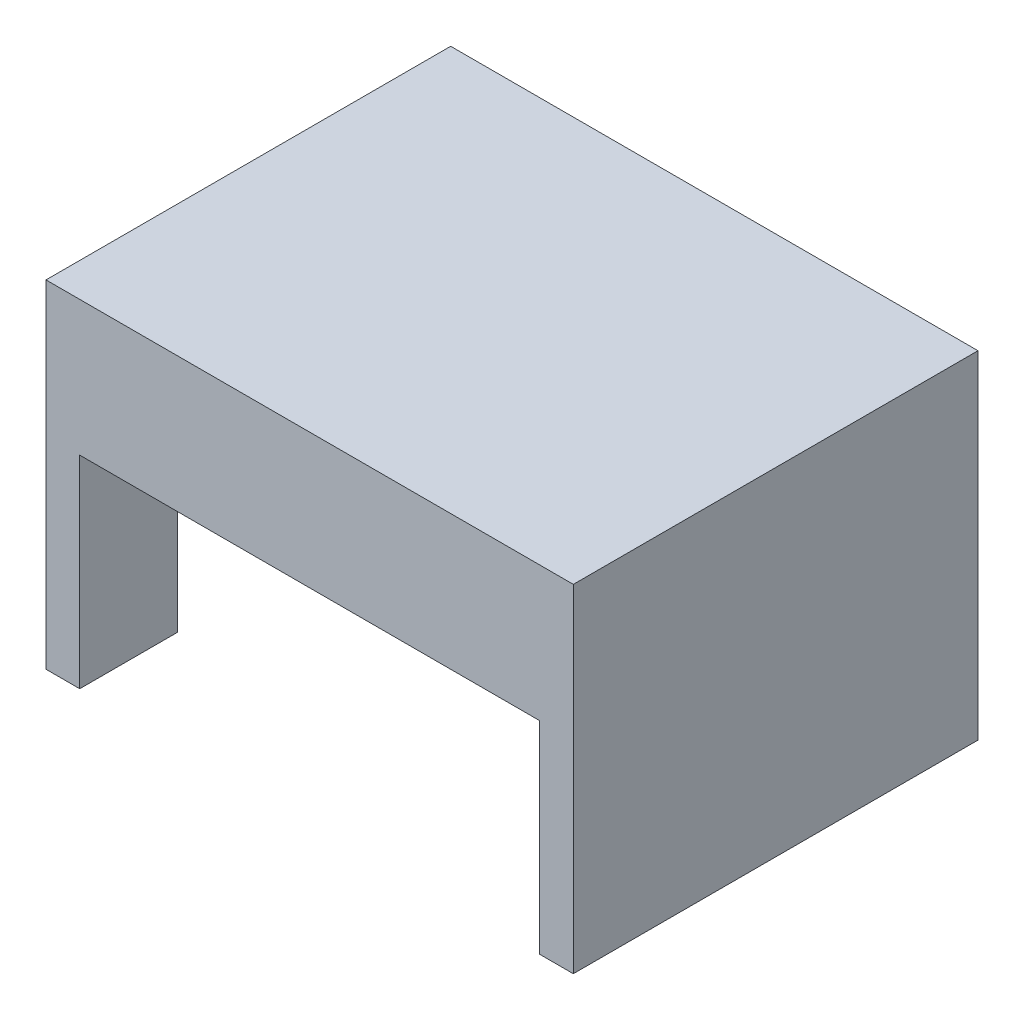
ISO-10303-21;
HEADER;
FILE_DESCRIPTION(('STEP AP214'),'2;1');
FILE_NAME('part.step','',(''),(''),'','','');
FILE_SCHEMA(('AUTOMOTIVE_DESIGN { 1 0 10303 214 1 1 1 1 }'));
ENDSEC;
DATA;
#1=APPLICATION_CONTEXT('core data for automotive mechanical design processes');
#2=APPLICATION_PROTOCOL_DEFINITION('international standard','automotive_design',2000,#1);
#3=PRODUCT_CONTEXT('',#1,'mechanical');
#4=PRODUCT('Part','Part','',(#3));
#5=PRODUCT_RELATED_PRODUCT_CATEGORY('part','',(#4));
#6=PRODUCT_DEFINITION_FORMATION('','',#4);
#7=PRODUCT_DEFINITION_CONTEXT('part definition',#1,'design');
#8=PRODUCT_DEFINITION('design','',#6,#7);
#9=PRODUCT_DEFINITION_SHAPE('','',#8);
#10=(LENGTH_UNIT() NAMED_UNIT(*) SI_UNIT(.MILLI.,.METRE.));
#11=(NAMED_UNIT(*) PLANE_ANGLE_UNIT() SI_UNIT($,.RADIAN.));
#12=(NAMED_UNIT(*) SI_UNIT($,.STERADIAN.) SOLID_ANGLE_UNIT());
#13=UNCERTAINTY_MEASURE_WITH_UNIT(LENGTH_MEASURE(1.E-05),#10,'distance_accuracy_value','');
#14=(GEOMETRIC_REPRESENTATION_CONTEXT(3) GLOBAL_UNCERTAINTY_ASSIGNED_CONTEXT((#13)) GLOBAL_UNIT_ASSIGNED_CONTEXT((#10,
#11,#12)) REPRESENTATION_CONTEXT('',''));
#15=CARTESIAN_POINT('',(0.,0.,0.));
#16=DIRECTION('',(0.,0.,1.));
#17=DIRECTION('',(1.,0.,0.));
#18=AXIS2_PLACEMENT_3D('',#15,#16,#17);
#19=CARTESIAN_POINT('',(-56.4103801603801,-36.4285714285714,60.));
#20=DIRECTION('',(0.,1.,0.));
#21=DIRECTION('',(0.,0.,1.));
#22=AXIS2_PLACEMENT_3D('',#19,#20,#21);
#23=PLANE('',#22);
#24=DIRECTION('',(0.,0.,-1.));
#25=VECTOR('',#24,1.);
#26=CARTESIAN_POINT('',(-51.4103801603801,-36.4285714285714,60.));
#27=LINE('',#26,#25);
#28=CARTESIAN_POINT('',(-51.4103801603801,-36.4285714285714,14.5));
#29=VERTEX_POINT('',#28);
#30=CARTESIAN_POINT('',(-51.4103801603801,-36.4285714285714,0.));
#31=VERTEX_POINT('',#30);
#32=EDGE_CURVE('E109',#29,#31,#27,.T.);
#33=ORIENTED_EDGE('',*,*,#32,.F.);
#34=DIRECTION('',(1.,0.,0.));
#35=VECTOR('',#34,1.);
#36=CARTESIAN_POINT('',(-51.4103801603801,-36.4285714285714,14.5));
#37=LINE('',#36,#35);
#38=CARTESIAN_POINT('',(-56.4103801603801,-36.4285714285714,14.5));
#39=VERTEX_POINT('',#38);
#40=EDGE_CURVE('E284',#39,#29,#37,.T.);
#41=ORIENTED_EDGE('',*,*,#40,.F.);
#42=DIRECTION('',(0.,0.,-1.));
#43=VECTOR('',#42,1.);
#44=CARTESIAN_POINT('',(-56.4103801603801,-36.4285714285714,60.));
#45=LINE('',#44,#43);
#46=CARTESIAN_POINT('',(-56.4103801603801,-36.4285714285714,0.));
#47=VERTEX_POINT('',#46);
#48=EDGE_CURVE('E224',#39,#47,#45,.T.);
#49=ORIENTED_EDGE('',*,*,#48,.T.);
#50=DIRECTION('',(1.,0.,0.));
#51=VECTOR('',#50,1.);
#52=CARTESIAN_POINT('',(-56.4103801603801,-36.4285714285714,0.));
#53=LINE('',#52,#51);
#54=EDGE_CURVE('E189',#47,#31,#53,.T.);
#55=ORIENTED_EDGE('',*,*,#54,.T.);
#56=EDGE_LOOP('',(#33,#41,#49,#55));
#57=FACE_BOUND('',#56,.T.);
#58=ADVANCED_FACE('F71',(#57),#23,.F.);
#59=CARTESIAN_POINT('',(-51.4103801603801,-6.42857142857144,60.));
#60=DIRECTION('',(1.,0.,0.));
#61=DIRECTION('',(0.,1.,0.));
#62=AXIS2_PLACEMENT_3D('',#59,#60,#61);
#63=PLANE('',#62);
#64=DIRECTION('',(0.,-1.,0.));
#65=VECTOR('',#64,1.);
#66=CARTESIAN_POINT('',(-51.4103801603801,3.57142857142857,14.5));
#67=LINE('',#66,#65);
#68=CARTESIAN_POINT('',(-51.4103801603801,-6.42857142857144,14.5));
#69=VERTEX_POINT('',#68);
#70=EDGE_CURVE('E265',#69,#29,#67,.T.);
#71=ORIENTED_EDGE('',*,*,#70,.T.);
#72=ORIENTED_EDGE('',*,*,#32,.T.);
#73=DIRECTION('',(0.,-1.,0.));
#74=VECTOR('',#73,1.);
#75=CARTESIAN_POINT('',(-51.4103801603801,-6.42857142857144,0.));
#76=LINE('',#75,#74);
#77=CARTESIAN_POINT('',(-51.4103801603801,-6.42857142857144,0.));
#78=VERTEX_POINT('',#77);
#79=EDGE_CURVE('E216',#78,#31,#76,.T.);
#80=ORIENTED_EDGE('',*,*,#79,.F.);
#81=DIRECTION('',(0.,0.,-1.));
#82=VECTOR('',#81,1.);
#83=CARTESIAN_POINT('',(-51.4103801603801,-6.42857142857144,60.));
#84=LINE('',#83,#82);
#85=EDGE_CURVE('E82',#69,#78,#84,.T.);
#86=ORIENTED_EDGE('',*,*,#85,.F.);
#87=EDGE_LOOP('',(#71,#72,#80,#86));
#88=FACE_BOUND('',#87,.T.);
#89=ADVANCED_FACE('F334',(#88),#63,.T.);
#90=CARTESIAN_POINT('',(0.,-6.42857142857144,60.));
#91=DIRECTION('',(0.,1.,0.));
#92=DIRECTION('',(-1.,0.,0.));
#93=AXIS2_PLACEMENT_3D('',#90,#91,#92);
#94=PLANE('',#93);
#95=CARTESIAN_POINT('',(-51.4103801603801,-6.42857142857144,60.));
#96=VERTEX_POINT('',#95);
#97=CARTESIAN_POINT('',(-51.4103801603801,-6.42857142857144,45.5));
#98=VERTEX_POINT('',#97);
#99=EDGE_CURVE('E12',#96,#98,#84,.T.);
#100=ORIENTED_EDGE('',*,*,#99,.T.);
#101=DIRECTION('',(-1.,0.,0.));
#102=VECTOR('',#101,1.);
#103=CARTESIAN_POINT('',(-51.4103801603801,-6.42857142857144,45.5));
#104=LINE('',#103,#102);
#105=CARTESIAN_POINT('',(16.7764330264331,-6.42857142857144,45.5));
#106=VERTEX_POINT('',#105);
#107=EDGE_CURVE('E257',#106,#98,#104,.T.);
#108=ORIENTED_EDGE('',*,*,#107,.F.);
#109=DIRECTION('',(0.,0.,-1.));
#110=VECTOR('',#109,1.);
#111=CARTESIAN_POINT('',(16.7764330264331,-6.42857142857144,60.));
#112=LINE('',#111,#110);
#113=CARTESIAN_POINT('',(16.7764330264331,-6.42857142857144,60.));
#114=VERTEX_POINT('',#113);
#115=EDGE_CURVE('E207',#114,#106,#112,.T.);
#116=ORIENTED_EDGE('',*,*,#115,.F.);
#117=DIRECTION('',(1.,0.,0.));
#118=VECTOR('',#117,1.);
#119=CARTESIAN_POINT('',(0.,-6.42857142857144,60.));
#120=LINE('',#119,#118);
#121=EDGE_CURVE('E191',#96,#114,#120,.T.);
#122=ORIENTED_EDGE('',*,*,#121,.F.);
#123=EDGE_LOOP('',(#100,#108,#116,#122));
#124=FACE_BOUND('',#123,.T.);
#125=ADVANCED_FACE('F338',(#124),#94,.F.);
#126=CARTESIAN_POINT('',(16.7764330264331,-6.42857142857144,14.5));
#127=VERTEX_POINT('',#126);
#128=CARTESIAN_POINT('',(16.7764330264331,-6.42857142857144,0.));
#129=VERTEX_POINT('',#128);
#130=EDGE_CURVE('E206',#127,#129,#112,.T.);
#131=ORIENTED_EDGE('',*,*,#130,.F.);
#132=DIRECTION('',(1.,0.,0.));
#133=VECTOR('',#132,1.);
#134=CARTESIAN_POINT('',(-51.4103801603801,-6.42857142857144,14.5));
#135=LINE('',#134,#133);
#136=EDGE_CURVE('E261',#69,#127,#135,.T.);
#137=ORIENTED_EDGE('',*,*,#136,.F.);
#138=ORIENTED_EDGE('',*,*,#85,.T.);
#139=DIRECTION('',(1.,0.,0.));
#140=VECTOR('',#139,1.);
#141=CARTESIAN_POINT('',(0.,-6.42857142857144,0.));
#142=LINE('',#141,#140);
#143=EDGE_CURVE('E223',#78,#129,#142,.T.);
#144=ORIENTED_EDGE('',*,*,#143,.T.);
#145=EDGE_LOOP('',(#131,#137,#138,#144));
#146=FACE_BOUND('',#145,.T.);
#147=ADVANCED_FACE('F329',(#146),#94,.F.);
#148=CARTESIAN_POINT('',(16.7764330264331,0.,60.));
#149=DIRECTION('',(1.,0.,0.));
#150=DIRECTION('',(0.,0.,-1.));
#151=AXIS2_PLACEMENT_3D('',#148,#149,#150);
#152=PLANE('',#151);
#153=DIRECTION('',(0.,-1.,0.));
#154=VECTOR('',#153,1.);
#155=CARTESIAN_POINT('',(16.7764330264331,0.,0.));
#156=LINE('',#155,#154);
#157=CARTESIAN_POINT('',(16.7764330264331,-36.4285714285714,0.));
#158=VERTEX_POINT('',#157);
#159=EDGE_CURVE('E232',#129,#158,#156,.T.);
#160=ORIENTED_EDGE('',*,*,#159,.T.);
#161=DIRECTION('',(0.,0.,-1.));
#162=VECTOR('',#161,1.);
#163=CARTESIAN_POINT('',(16.7764330264331,-36.4285714285714,60.));
#164=LINE('',#163,#162);
#165=CARTESIAN_POINT('',(16.7764330264331,-36.4285714285714,60.));
#166=VERTEX_POINT('',#165);
#167=EDGE_CURVE('E203',#166,#158,#164,.T.);
#168=ORIENTED_EDGE('',*,*,#167,.F.);
#169=DIRECTION('',(0.,-1.,0.));
#170=VECTOR('',#169,1.);
#171=CARTESIAN_POINT('',(16.7764330264331,0.,60.));
#172=LINE('',#171,#170);
#173=EDGE_CURVE('E194',#114,#166,#172,.T.);
#174=ORIENTED_EDGE('',*,*,#173,.F.);
#175=ORIENTED_EDGE('',*,*,#115,.T.);
#176=DIRECTION('',(0.,-1.,0.));
#177=VECTOR('',#176,1.);
#178=CARTESIAN_POINT('',(16.7764330264331,3.57142857142856,45.5));
#179=LINE('',#178,#177);
#180=CARTESIAN_POINT('',(16.7764330264331,3.57142857142856,45.5));
#181=VERTEX_POINT('',#180);
#182=EDGE_CURVE('E119',#181,#106,#179,.T.);
#183=ORIENTED_EDGE('',*,*,#182,.F.);
#184=DIRECTION('',(0.,0.,1.));
#185=VECTOR('',#184,1.);
#186=CARTESIAN_POINT('',(16.7764330264331,3.57142857142856,14.5));
#187=LINE('',#186,#185);
#188=CARTESIAN_POINT('',(16.7764330264331,3.57142857142856,14.5));
#189=VERTEX_POINT('',#188);
#190=EDGE_CURVE('E250',#189,#181,#187,.T.);
#191=ORIENTED_EDGE('',*,*,#190,.F.);
#192=DIRECTION('',(0.,-1.,0.));
#193=VECTOR('',#192,1.);
#194=CARTESIAN_POINT('',(16.7764330264331,3.57142857142856,14.5));
#195=LINE('',#194,#193);
#196=EDGE_CURVE('E243',#189,#127,#195,.T.);
#197=ORIENTED_EDGE('',*,*,#196,.T.);
#198=ORIENTED_EDGE('',*,*,#130,.T.);
#199=EDGE_LOOP('',(#160,#168,#174,#175,#183,#191,#197,#198));
#200=FACE_BOUND('',#199,.T.);
#201=ADVANCED_FACE('F326',(#200),#152,.F.);
#202=CARTESIAN_POINT('',(0.,-36.4285714285714,60.));
#203=DIRECTION('',(0.,-1.,0.));
#204=DIRECTION('',(0.,0.,-1.));
#205=AXIS2_PLACEMENT_3D('',#202,#203,#204);
#206=PLANE('',#205);
#207=DIRECTION('',(-1.,0.,0.));
#208=VECTOR('',#207,1.);
#209=CARTESIAN_POINT('',(0.,-36.4285714285714,0.));
#210=LINE('',#209,#208);
#211=CARTESIAN_POINT('',(21.7764330264331,-36.4285714285714,0.));
#212=VERTEX_POINT('',#211);
#213=EDGE_CURVE('E312',#212,#158,#210,.T.);
#214=ORIENTED_EDGE('',*,*,#213,.F.);
#215=DIRECTION('',(0.,0.,-1.));
#216=VECTOR('',#215,1.);
#217=CARTESIAN_POINT('',(21.7764330264331,-36.4285714285714,60.));
#218=LINE('',#217,#216);
#219=CARTESIAN_POINT('',(21.7764330264331,-36.4285714285714,60.));
#220=VERTEX_POINT('',#219);
#221=EDGE_CURVE('E200',#220,#212,#218,.T.);
#222=ORIENTED_EDGE('',*,*,#221,.F.);
#223=DIRECTION('',(-1.,0.,0.));
#224=VECTOR('',#223,1.);
#225=CARTESIAN_POINT('',(0.,-36.4285714285714,60.));
#226=LINE('',#225,#224);
#227=EDGE_CURVE('E297',#220,#166,#226,.T.);
#228=ORIENTED_EDGE('',*,*,#227,.T.);
#229=ORIENTED_EDGE('',*,*,#167,.T.);
#230=EDGE_LOOP('',(#214,#222,#228,#229));
#231=FACE_BOUND('',#230,.T.);
#232=ADVANCED_FACE('F322',(#231),#206,.T.);
#233=CARTESIAN_POINT('',(21.7764330264331,0.,60.));
#234=DIRECTION('',(-1.,0.,0.));
#235=DIRECTION('',(0.,-1.,0.));
#236=AXIS2_PLACEMENT_3D('',#233,#234,#235);
#237=PLANE('',#236);
#238=DIRECTION('',(0.,1.,0.));
#239=VECTOR('',#238,1.);
#240=CARTESIAN_POINT('',(21.7764330264331,0.,0.));
#241=LINE('',#240,#239);
#242=CARTESIAN_POINT('',(21.7764330264331,13.5714285714286,0.));
#243=VERTEX_POINT('',#242);
#244=EDGE_CURVE('E184',#212,#243,#241,.T.);
#245=ORIENTED_EDGE('',*,*,#244,.T.);
#246=DIRECTION('',(0.,0.,-1.));
#247=VECTOR('',#246,1.);
#248=CARTESIAN_POINT('',(21.7764330264331,13.5714285714286,60.));
#249=LINE('',#248,#247);
#250=CARTESIAN_POINT('',(21.7764330264331,13.5714285714286,60.));
#251=VERTEX_POINT('',#250);
#252=EDGE_CURVE('E174',#251,#243,#249,.T.);
#253=ORIENTED_EDGE('',*,*,#252,.F.);
#254=DIRECTION('',(0.,1.,0.));
#255=VECTOR('',#254,1.);
#256=CARTESIAN_POINT('',(21.7764330264331,0.,60.));
#257=LINE('',#256,#255);
#258=EDGE_CURVE('E301',#220,#251,#257,.T.);
#259=ORIENTED_EDGE('',*,*,#258,.F.);
#260=ORIENTED_EDGE('',*,*,#221,.T.);
#261=EDGE_LOOP('',(#245,#253,#259,#260));
#262=FACE_BOUND('',#261,.T.);
#263=ADVANCED_FACE('F317',(#262),#237,.F.);
#264=CARTESIAN_POINT('',(0.,13.5714285714286,60.));
#265=DIRECTION('',(0.,1.,0.));
#266=DIRECTION('',(0.,0.,1.));
#267=AXIS2_PLACEMENT_3D('',#264,#265,#266);
#268=PLANE('',#267);
#269=DIRECTION('',(1.,0.,0.));
#270=VECTOR('',#269,1.);
#271=CARTESIAN_POINT('',(0.,13.5714285714286,0.));
#272=LINE('',#271,#270);
#273=CARTESIAN_POINT('',(-56.4103801603801,13.5714285714286,0.));
#274=VERTEX_POINT('',#273);
#275=EDGE_CURVE('E177',#274,#243,#272,.T.);
#276=ORIENTED_EDGE('',*,*,#275,.F.);
#277=DIRECTION('',(0.,0.,-1.));
#278=VECTOR('',#277,1.);
#279=CARTESIAN_POINT('',(-56.4103801603801,13.5714285714286,60.));
#280=LINE('',#279,#278);
#281=CARTESIAN_POINT('',(-56.4103801603801,13.5714285714286,60.));
#282=VERTEX_POINT('',#281);
#283=EDGE_CURVE('E160',#282,#274,#280,.T.);
#284=ORIENTED_EDGE('',*,*,#283,.F.);
#285=DIRECTION('',(1.,0.,0.));
#286=VECTOR('',#285,1.);
#287=CARTESIAN_POINT('',(0.,13.5714285714286,60.));
#288=LINE('',#287,#286);
#289=EDGE_CURVE('E304',#282,#251,#288,.T.);
#290=ORIENTED_EDGE('',*,*,#289,.T.);
#291=ORIENTED_EDGE('',*,*,#252,.T.);
#292=EDGE_LOOP('',(#276,#284,#290,#291));
#293=FACE_BOUND('',#292,.T.);
#294=ADVANCED_FACE('F178',(#293),#268,.T.);
#295=CARTESIAN_POINT('',(-56.4103801603801,0.,60.));
#296=DIRECTION('',(-1.,0.,0.));
#297=DIRECTION('',(0.,0.,1.));
#298=AXIS2_PLACEMENT_3D('',#295,#296,#297);
#299=PLANE('',#298);
#300=DIRECTION('',(0.,-1.,0.));
#301=VECTOR('',#300,1.);
#302=CARTESIAN_POINT('',(-56.4103801603801,3.57142857142857,14.5));
#303=LINE('',#302,#301);
#304=CARTESIAN_POINT('',(-56.4103801603801,3.57142857142857,14.5));
#305=VERTEX_POINT('',#304);
#306=EDGE_CURVE('E268',#305,#39,#303,.T.);
#307=ORIENTED_EDGE('',*,*,#306,.F.);
#308=DIRECTION('',(0.,0.,-1.));
#309=VECTOR('',#308,1.);
#310=CARTESIAN_POINT('',(-56.4103801603801,3.57142857142857,14.5));
#311=LINE('',#310,#309);
#312=CARTESIAN_POINT('',(-56.4103801603801,3.57142857142857,45.5));
#313=VERTEX_POINT('',#312);
#314=EDGE_CURVE('E280',#313,#305,#311,.T.);
#315=ORIENTED_EDGE('',*,*,#314,.F.);
#316=DIRECTION('',(0.,-1.,0.));
#317=VECTOR('',#316,1.);
#318=CARTESIAN_POINT('',(-56.4103801603801,3.57142857142857,45.5));
#319=LINE('',#318,#317);
#320=CARTESIAN_POINT('',(-56.4103801603801,-36.4285714285714,45.5));
#321=VERTEX_POINT('',#320);
#322=EDGE_CURVE('E272',#313,#321,#319,.T.);
#323=ORIENTED_EDGE('',*,*,#322,.T.);
#324=CARTESIAN_POINT('',(-56.4103801603801,-36.4285714285714,60.));
#325=VERTEX_POINT('',#324);
#326=EDGE_CURVE('E220',#325,#321,#45,.T.);
#327=ORIENTED_EDGE('',*,*,#326,.F.);
#328=DIRECTION('',(0.,1.,0.));
#329=VECTOR('',#328,1.);
#330=CARTESIAN_POINT('',(-56.4103801603801,0.,60.));
#331=LINE('',#330,#329);
#332=EDGE_CURVE('E169',#325,#282,#331,.T.);
#333=ORIENTED_EDGE('',*,*,#332,.T.);
#334=ORIENTED_EDGE('',*,*,#283,.T.);
#335=DIRECTION('',(0.,1.,0.));
#336=VECTOR('',#335,1.);
#337=CARTESIAN_POINT('',(-56.4103801603801,0.,0.));
#338=LINE('',#337,#336);
#339=EDGE_CURVE('E166',#47,#274,#338,.T.);
#340=ORIENTED_EDGE('',*,*,#339,.F.);
#341=ORIENTED_EDGE('',*,*,#48,.F.);
#342=EDGE_LOOP('',(#307,#315,#323,#327,#333,#334,#340,#341));
#343=FACE_BOUND('',#342,.T.);
#344=ADVANCED_FACE('F163',(#343),#299,.T.);
#345=CARTESIAN_POINT('',(0.,0.,60.));
#346=DIRECTION('',(0.,0.,1.));
#347=DIRECTION('',(1.,0.,0.));
#348=AXIS2_PLACEMENT_3D('',#345,#346,#347);
#349=PLANE('',#348);
#350=ORIENTED_EDGE('',*,*,#332,.F.);
#351=DIRECTION('',(1.,0.,0.));
#352=VECTOR('',#351,1.);
#353=CARTESIAN_POINT('',(-56.4103801603801,-36.4285714285714,60.));
#354=LINE('',#353,#352);
#355=CARTESIAN_POINT('',(-51.4103801603801,-36.4285714285714,60.));
#356=VERTEX_POINT('',#355);
#357=EDGE_CURVE('E213',#325,#356,#354,.T.);
#358=ORIENTED_EDGE('',*,*,#357,.T.);
#359=DIRECTION('',(0.,-1.,0.));
#360=VECTOR('',#359,1.);
#361=CARTESIAN_POINT('',(-51.4103801603801,-6.42857142857144,60.));
#362=LINE('',#361,#360);
#363=EDGE_CURVE('E210',#96,#356,#362,.T.);
#364=ORIENTED_EDGE('',*,*,#363,.F.);
#365=ORIENTED_EDGE('',*,*,#121,.T.);
#366=ORIENTED_EDGE('',*,*,#173,.T.);
#367=ORIENTED_EDGE('',*,*,#227,.F.);
#368=ORIENTED_EDGE('',*,*,#258,.T.);
#369=ORIENTED_EDGE('',*,*,#289,.F.);
#370=EDGE_LOOP('',(#350,#358,#364,#365,#366,#367,#368,#369));
#371=FACE_BOUND('',#370,.T.);
#372=ADVANCED_FACE('F368',(#371),#349,.T.);
#373=CARTESIAN_POINT('',(0.,0.,0.));
#374=DIRECTION('',(0.,0.,1.));
#375=DIRECTION('',(1.,0.,0.));
#376=AXIS2_PLACEMENT_3D('',#373,#374,#375);
#377=PLANE('',#376);
#378=ORIENTED_EDGE('',*,*,#143,.F.);
#379=ORIENTED_EDGE('',*,*,#79,.T.);
#380=ORIENTED_EDGE('',*,*,#54,.F.);
#381=ORIENTED_EDGE('',*,*,#339,.T.);
#382=ORIENTED_EDGE('',*,*,#275,.T.);
#383=ORIENTED_EDGE('',*,*,#244,.F.);
#384=ORIENTED_EDGE('',*,*,#213,.T.);
#385=ORIENTED_EDGE('',*,*,#159,.F.);
#386=EDGE_LOOP('',(#378,#379,#380,#381,#382,#383,#384,#385));
#387=FACE_BOUND('',#386,.T.);
#388=ADVANCED_FACE('F187',(#387),#377,.F.);
#389=ORIENTED_EDGE('',*,*,#326,.T.);
#390=DIRECTION('',(-1.,0.,0.));
#391=VECTOR('',#390,1.);
#392=CARTESIAN_POINT('',(-51.4103801603801,-36.4285714285714,45.5));
#393=LINE('',#392,#391);
#394=CARTESIAN_POINT('',(-51.4103801603801,-36.4285714285714,45.5));
#395=VERTEX_POINT('',#394);
#396=EDGE_CURVE('E288',#395,#321,#393,.T.);
#397=ORIENTED_EDGE('',*,*,#396,.F.);
#398=EDGE_CURVE('E75',#356,#395,#27,.T.);
#399=ORIENTED_EDGE('',*,*,#398,.F.);
#400=ORIENTED_EDGE('',*,*,#357,.F.);
#401=EDGE_LOOP('',(#389,#397,#399,#400));
#402=FACE_BOUND('',#401,.T.);
#403=ADVANCED_FACE('F345',(#402),#23,.F.);
#404=DIRECTION('',(0.,-1.,0.));
#405=VECTOR('',#404,1.);
#406=CARTESIAN_POINT('',(-51.4103801603801,3.57142857142857,45.5));
#407=LINE('',#406,#405);
#408=EDGE_CURVE('E276',#98,#395,#407,.T.);
#409=ORIENTED_EDGE('',*,*,#408,.F.);
#410=ORIENTED_EDGE('',*,*,#99,.F.);
#411=ORIENTED_EDGE('',*,*,#363,.T.);
#412=ORIENTED_EDGE('',*,*,#398,.T.);
#413=EDGE_LOOP('',(#409,#410,#411,#412));
#414=FACE_BOUND('',#413,.T.);
#415=ADVANCED_FACE('F73',(#414),#63,.T.);
#416=CARTESIAN_POINT('',(-51.4103801603801,3.57142857142856,45.5));
#417=DIRECTION('',(0.,0.,1.));
#418=DIRECTION('',(1.,0.,0.));
#419=AXIS2_PLACEMENT_3D('',#416,#417,#418);
#420=PLANE('',#419);
#421=ORIENTED_EDGE('',*,*,#107,.T.);
#422=ORIENTED_EDGE('',*,*,#408,.T.);
#423=ORIENTED_EDGE('',*,*,#396,.T.);
#424=ORIENTED_EDGE('',*,*,#322,.F.);
#425=DIRECTION('',(-1.,0.,0.));
#426=VECTOR('',#425,1.);
#427=CARTESIAN_POINT('',(-51.4103801603801,3.57142857142856,45.5));
#428=LINE('',#427,#426);
#429=EDGE_CURVE('E246',#181,#313,#428,.T.);
#430=ORIENTED_EDGE('',*,*,#429,.F.);
#431=ORIENTED_EDGE('',*,*,#182,.T.);
#432=EDGE_LOOP('',(#421,#422,#423,#424,#430,#431));
#433=FACE_BOUND('',#432,.T.);
#434=ADVANCED_FACE('F347',(#433),#420,.F.);
#435=CARTESIAN_POINT('',(-51.4103801603801,3.57142857142856,14.5));
#436=DIRECTION('',(0.,0.,-1.));
#437=DIRECTION('',(-1.,0.,0.));
#438=AXIS2_PLACEMENT_3D('',#435,#436,#437);
#439=PLANE('',#438);
#440=ORIENTED_EDGE('',*,*,#136,.T.);
#441=ORIENTED_EDGE('',*,*,#196,.F.);
#442=DIRECTION('',(1.,0.,0.));
#443=VECTOR('',#442,1.);
#444=CARTESIAN_POINT('',(-51.4103801603801,3.57142857142856,14.5));
#445=LINE('',#444,#443);
#446=EDGE_CURVE('E253',#305,#189,#445,.T.);
#447=ORIENTED_EDGE('',*,*,#446,.F.);
#448=ORIENTED_EDGE('',*,*,#306,.T.);
#449=ORIENTED_EDGE('',*,*,#40,.T.);
#450=ORIENTED_EDGE('',*,*,#70,.F.);
#451=EDGE_LOOP('',(#440,#441,#447,#448,#449,#450));
#452=FACE_BOUND('',#451,.T.);
#453=ADVANCED_FACE('F352',(#452),#439,.F.);
#454=CARTESIAN_POINT('',(0.,3.57142857142856,0.));
#455=DIRECTION('',(0.,1.,0.));
#456=DIRECTION('',(-1.,0.,0.));
#457=AXIS2_PLACEMENT_3D('',#454,#455,#456);
#458=PLANE('',#457);
#459=ORIENTED_EDGE('',*,*,#429,.T.);
#460=ORIENTED_EDGE('',*,*,#314,.T.);
#461=ORIENTED_EDGE('',*,*,#446,.T.);
#462=ORIENTED_EDGE('',*,*,#190,.T.);
#463=EDGE_LOOP('',(#459,#460,#461,#462));
#464=FACE_BOUND('',#463,.T.);
#465=ADVANCED_FACE('F375',(#464),#458,.F.);
#466=CLOSED_SHELL('',(#58,#89,#125,#147,#201,#232,#263,#294,#344,#372,#388,#403,#415,#434,#453,#465));
#467=MANIFOLD_SOLID_BREP('B2',#466);
#468=ADVANCED_BREP_SHAPE_REPRESENTATION('',(#18,#467),#14);
#469=SHAPE_DEFINITION_REPRESENTATION(#9,#468);
ENDSEC;
END-ISO-10303-21;
